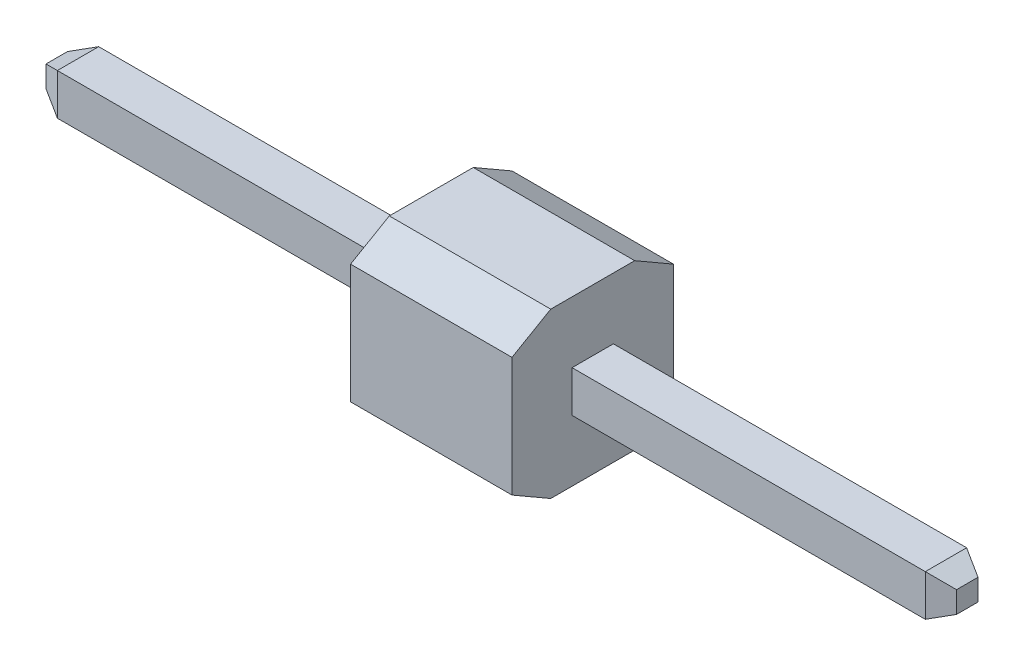
ISO-10303-21;
HEADER;
FILE_DESCRIPTION(('STEP AP214'),'2;1');
FILE_NAME('part.step','',(''),(''),'','','');
FILE_SCHEMA(('AUTOMOTIVE_DESIGN { 1 0 10303 214 1 1 1 1 }'));
ENDSEC;
DATA;
#1=APPLICATION_CONTEXT('core data for automotive mechanical design processes');
#2=APPLICATION_PROTOCOL_DEFINITION('international standard','automotive_design',2000,#1);
#3=PRODUCT_CONTEXT('',#1,'mechanical');
#4=PRODUCT('Part','Part','',(#3));
#5=PRODUCT_RELATED_PRODUCT_CATEGORY('part','',(#4));
#6=PRODUCT_DEFINITION_FORMATION('','',#4);
#7=PRODUCT_DEFINITION_CONTEXT('part definition',#1,'design');
#8=PRODUCT_DEFINITION('design','',#6,#7);
#9=PRODUCT_DEFINITION_SHAPE('','',#8);
#10=(LENGTH_UNIT() NAMED_UNIT(*) SI_UNIT(.MILLI.,.METRE.));
#11=(NAMED_UNIT(*) PLANE_ANGLE_UNIT() SI_UNIT($,.RADIAN.));
#12=(NAMED_UNIT(*) SI_UNIT($,.STERADIAN.) SOLID_ANGLE_UNIT());
#13=UNCERTAINTY_MEASURE_WITH_UNIT(LENGTH_MEASURE(1.E-05),#10,'distance_accuracy_value','');
#14=(GEOMETRIC_REPRESENTATION_CONTEXT(3) GLOBAL_UNCERTAINTY_ASSIGNED_CONTEXT((#13)) GLOBAL_UNIT_ASSIGNED_CONTEXT((#10,
#11,#12)) REPRESENTATION_CONTEXT('',''));
#15=CARTESIAN_POINT('',(0.,0.,0.));
#16=DIRECTION('',(0.,0.,1.));
#17=DIRECTION('',(1.,0.,0.));
#18=AXIS2_PLACEMENT_3D('',#15,#16,#17);
#19=CARTESIAN_POINT('',(5.42107464275443,-9.84288427394286,-2.77111970734936));
#20=DIRECTION('',(1.,-9.93476518829084E-08,4.37113882867379E-08));
#21=DIRECTION('',(-9.93476589883358E-08,-1.,8.74227765734759E-08));
#22=AXIS2_PLACEMENT_3D('',#19,#20,#21);
#23=PLANE('',#22);
#24=DIRECTION('',(-1.18186632778994E-08,-0.500000075710538,-0.866025360072935));
#25=VECTOR('',#24,1.);
#26=CARTESIAN_POINT('',(5.42107445057982,-11.0864739751751,-1.20111959863128));
#27=LINE('',#26,#25);
#28=CARTESIAN_POINT('',(5.42107445057982,-11.0864739751751,-1.20111959863128));
#29=VERTEX_POINT('',#28);
#30=CARTESIAN_POINT('',(5.42107444239161,-11.4328841891428,-1.80111956834714));
#31=VERTEX_POINT('',#30);
#32=EDGE_CURVE('E11',#29,#31,#27,.T.);
#33=ORIENTED_EDGE('',*,*,#32,.T.);
#34=DIRECTION('',(4.37113811813104E-08,-8.74227842254741E-08,-0.999999999999995));
#35=VECTOR('',#34,1.);
#36=CARTESIAN_POINT('',(5.42107444239161,-11.4328841891428,-1.80111956834714));
#37=LINE('',#36,#35);
#38=CARTESIAN_POINT('',(5.42107449921641,-11.4328843027924,-3.10111956834714));
#39=VERTEX_POINT('',#38);
#40=EDGE_CURVE('E304',#31,#39,#37,.T.);
#41=ORIENTED_EDGE('',*,*,#40,.T.);
#42=DIRECTION('',(8.75289963529268E-08,0.499999924289837,-0.866025447495713));
#43=VECTOR('',#42,1.);
#44=CARTESIAN_POINT('',(5.42107449921641,-11.4328843027924,-3.10111956834714));
#45=LINE('',#44,#43);
#46=CARTESIAN_POINT('',(5.42107455985828,-11.086474193732,-3.70111959863128));
#47=VERTEX_POINT('',#46);
#48=EDGE_CURVE('E296',#39,#47,#45,.T.);
#49=ORIENTED_EDGE('',*,*,#48,.T.);
#50=DIRECTION('',(9.93476593243698E-08,0.999999999999991,-8.74227764821842E-08));
#51=VECTOR('',#50,1.);
#52=CARTESIAN_POINT('',(5.42107455985828,-11.086474193732,-3.70111959863128));
#53=LINE('',#52,#51);
#54=CARTESIAN_POINT('',(5.42107474337125,-9.23929451676005,-3.70111976011686));
#55=VERTEX_POINT('',#54);
#56=EDGE_CURVE('E281',#47,#55,#53,.T.);
#57=ORIENTED_EDGE('',*,*,#56,.T.);
#58=DIRECTION('',(-1.18186619959243E-08,-0.500000075710538,-0.866025360072935));
#59=VECTOR('',#58,1.);
#60=CARTESIAN_POINT('',(5.42107475155946,-8.89288430279238,-3.10111979040099));
#61=LINE('',#60,#59);
#62=CARTESIAN_POINT('',(5.42107475155946,-8.89288430279238,-3.10111979040099));
#63=VERTEX_POINT('',#62);
#64=EDGE_CURVE('E265',#63,#55,#61,.T.);
#65=ORIENTED_EDGE('',*,*,#64,.F.);
#66=DIRECTION('',(4.37113811813104E-08,-8.74227842254741E-08,-0.999999999999995));
#67=VECTOR('',#66,1.);
#68=CARTESIAN_POINT('',(5.42107469473467,-8.89288418914276,-1.80111979040099));
#69=LINE('',#68,#67);
#70=CARTESIAN_POINT('',(5.42107469473467,-8.89288418914276,-1.80111979040099));
#71=VERTEX_POINT('',#70);
#72=EDGE_CURVE('E248',#71,#63,#69,.T.);
#73=ORIENTED_EDGE('',*,*,#72,.F.);
#74=DIRECTION('',(8.75289950709517E-08,0.499999924289837,-0.866025447495713));
#75=VECTOR('',#74,1.);
#76=CARTESIAN_POINT('',(5.4210746340928,-9.23929429820309,-1.20111976011686));
#77=LINE('',#76,#75);
#78=CARTESIAN_POINT('',(5.4210746340928,-9.23929429820309,-1.20111976011686));
#79=VERTEX_POINT('',#78);
#80=EDGE_CURVE('E242',#79,#71,#77,.T.);
#81=ORIENTED_EDGE('',*,*,#80,.F.);
#82=DIRECTION('',(9.93476593243698E-08,0.999999999999991,-8.74227764821842E-08));
#83=VECTOR('',#82,1.);
#84=CARTESIAN_POINT('',(5.42107445057982,-11.0864739751751,-1.20111959863128));
#85=LINE('',#84,#83);
#86=EDGE_CURVE('E236',#29,#79,#85,.T.);
#87=ORIENTED_EDGE('',*,*,#86,.F.);
#88=EDGE_LOOP('',(#33,#41,#49,#57,#65,#73,#81,#87));
#89=FACE_BOUND('',#88,.T.);
#90=DIRECTION('',(-4.37113817364219E-08,8.74227829017466E-08,0.999999999999995));
#91=VECTOR('',#90,1.);
#92=CARTESIAN_POINT('',(5.42107457917193,-10.4828842739429,-2.77111965139878));
#93=LINE('',#92,#91);
#94=CARTESIAN_POINT('',(5.42107457917193,-10.4828842739429,-2.77111965139878));
#95=VERTEX_POINT('',#94);
#96=CARTESIAN_POINT('',(5.42107455119664,-10.4828842179923,-2.13111965139878));
#97=VERTEX_POINT('',#96);
#98=EDGE_CURVE('E302',#95,#97,#93,.T.);
#99=ORIENTED_EDGE('',*,*,#98,.T.);
#100=DIRECTION('',(-9.93476592658906E-08,-0.999999999999991,8.74227766567418E-08));
#101=VECTOR('',#100,1.);
#102=CARTESIAN_POINT('',(5.42107461477915,-9.84288421799228,-2.13111970734936));
#103=LINE('',#102,#101);
#104=CARTESIAN_POINT('',(5.42107461477915,-9.84288421799228,-2.13111970734936));
#105=VERTEX_POINT('',#104);
#106=EDGE_CURVE('E293',#105,#97,#103,.T.);
#107=ORIENTED_EDGE('',*,*,#106,.F.);
#108=DIRECTION('',(-4.37113817364219E-08,8.74227856773042E-08,0.999999999999995));
#109=VECTOR('',#108,1.);
#110=CARTESIAN_POINT('',(5.42107464275443,-9.84288427394286,-2.77111970734936));
#111=LINE('',#110,#109);
#112=CARTESIAN_POINT('',(5.42107464275443,-9.84288427394286,-2.77111970734936));
#113=VERTEX_POINT('',#112);
#114=EDGE_CURVE('E278',#113,#105,#111,.T.);
#115=ORIENTED_EDGE('',*,*,#114,.F.);
#116=DIRECTION('',(-9.93476592658908E-08,-0.999999999999991,8.7422776656742E-08));
#117=VECTOR('',#116,1.);
#118=CARTESIAN_POINT('',(5.42107464275443,-9.84288427394286,-2.77111970734936));
#119=LINE('',#118,#117);
#120=EDGE_CURVE('E263',#113,#95,#119,.T.);
#121=ORIENTED_EDGE('',*,*,#120,.T.);
#122=EDGE_LOOP('',(#99,#107,#115,#121));
#123=FACE_BOUND('',#122,.T.);
#124=ADVANCED_FACE('F17',(#89,#123),#23,.T.);
#125=CARTESIAN_POINT('',(2.92107464275443,-9.84288402557373,-2.77111981662783));
#126=DIRECTION('',(1.,-9.93476518829084E-08,4.37113882867379E-08));
#127=DIRECTION('',(-9.93476589883358E-08,-1.,8.74227765734759E-08));
#128=AXIS2_PLACEMENT_3D('',#125,#126,#127);
#129=PLANE('',#128);
#130=DIRECTION('',(-1.18186632778994E-08,-0.500000075710538,-0.866025360072935));
#131=VECTOR('',#130,1.);
#132=CARTESIAN_POINT('',(2.92107445057982,-11.086473726806,-1.20111970790975));
#133=LINE('',#132,#131);
#134=CARTESIAN_POINT('',(2.92107445057982,-11.086473726806,-1.20111970790975));
#135=VERTEX_POINT('',#134);
#136=CARTESIAN_POINT('',(2.92107444239161,-11.4328839407736,-1.80111967762561));
#137=VERTEX_POINT('',#136);
#138=EDGE_CURVE('E24',#135,#137,#133,.T.);
#139=ORIENTED_EDGE('',*,*,#138,.F.);
#140=DIRECTION('',(9.9347659083955E-08,0.999999999999991,-8.74227764821842E-08));
#141=VECTOR('',#140,1.);
#142=CARTESIAN_POINT('',(2.92107445057982,-11.086473726806,-1.20111970790975));
#143=LINE('',#142,#141);
#144=CARTESIAN_POINT('',(2.9210746340928,-9.23929404983396,-1.20111986939533));
#145=VERTEX_POINT('',#144);
#146=EDGE_CURVE('E300',#135,#145,#143,.T.);
#147=ORIENTED_EDGE('',*,*,#146,.T.);
#148=DIRECTION('',(8.75289957119392E-08,0.499999924289837,-0.866025447495713));
#149=VECTOR('',#148,1.);
#150=CARTESIAN_POINT('',(2.9210746340928,-9.23929404983396,-1.20111986939533));
#151=LINE('',#150,#149);
#152=CARTESIAN_POINT('',(2.92107469473467,-8.89288394077363,-1.80111989967946));
#153=VERTEX_POINT('',#152);
#154=EDGE_CURVE('E286',#145,#153,#151,.T.);
#155=ORIENTED_EDGE('',*,*,#154,.T.);
#156=DIRECTION('',(4.37113811813104E-08,-8.74227842254741E-08,-0.999999999999995));
#157=VECTOR('',#156,1.);
#158=CARTESIAN_POINT('',(2.92107469473467,-8.89288394077363,-1.80111989967946));
#159=LINE('',#158,#157);
#160=CARTESIAN_POINT('',(2.92107475155946,-8.89288405442325,-3.10111989967946));
#161=VERTEX_POINT('',#160);
#162=EDGE_CURVE('E271',#153,#161,#159,.T.);
#163=ORIENTED_EDGE('',*,*,#162,.T.);
#164=DIRECTION('',(-1.18186626369119E-08,-0.500000075710538,-0.866025360072935));
#165=VECTOR('',#164,1.);
#166=CARTESIAN_POINT('',(2.92107475155946,-8.89288405442325,-3.10111989967946));
#167=LINE('',#166,#165);
#168=CARTESIAN_POINT('',(2.92107474337125,-9.23929426839092,-3.70111986939533));
#169=VERTEX_POINT('',#168);
#170=EDGE_CURVE('E253',#161,#169,#167,.T.);
#171=ORIENTED_EDGE('',*,*,#170,.T.);
#172=DIRECTION('',(9.9347659083955E-08,0.999999999999991,-8.74227764821842E-08));
#173=VECTOR('',#172,1.);
#174=CARTESIAN_POINT('',(2.92107455985828,-11.0864739453629,-3.70111970790975));
#175=LINE('',#174,#173);
#176=CARTESIAN_POINT('',(2.92107455985828,-11.0864739453629,-3.70111970790975));
#177=VERTEX_POINT('',#176);
#178=EDGE_CURVE('E261',#177,#169,#175,.T.);
#179=ORIENTED_EDGE('',*,*,#178,.F.);
#180=DIRECTION('',(8.75289963529268E-08,0.499999924289837,-0.866025447495713));
#181=VECTOR('',#180,1.);
#182=CARTESIAN_POINT('',(2.92107449921641,-11.4328840544232,-3.10111967762561));
#183=LINE('',#182,#181);
#184=CARTESIAN_POINT('',(2.92107449921641,-11.4328840544232,-3.10111967762561));
#185=VERTEX_POINT('',#184);
#186=EDGE_CURVE('E276',#185,#177,#183,.T.);
#187=ORIENTED_EDGE('',*,*,#186,.F.);
#188=DIRECTION('',(4.37113811813104E-08,-8.74227842254741E-08,-0.999999999999995));
#189=VECTOR('',#188,1.);
#190=CARTESIAN_POINT('',(2.92107444239161,-11.4328839407736,-1.80111967762561));
#191=LINE('',#190,#189);
#192=EDGE_CURVE('E291',#137,#185,#191,.T.);
#193=ORIENTED_EDGE('',*,*,#192,.F.);
#194=EDGE_LOOP('',(#139,#147,#155,#163,#171,#179,#187,#193));
#195=FACE_BOUND('',#194,.T.);
#196=DIRECTION('',(-9.93476585720012E-08,-0.999999999999991,8.74227766567418E-08));
#197=VECTOR('',#196,1.);
#198=CARTESIAN_POINT('',(2.92107461477915,-9.84288396962315,-2.13111981662783));
#199=LINE('',#198,#197);
#200=CARTESIAN_POINT('',(2.92107461477915,-9.84288396962315,-2.13111981662783));
#201=VERTEX_POINT('',#200);
#202=CARTESIAN_POINT('',(2.92107455119665,-10.4828839696231,-2.13111976067725));
#203=VERTEX_POINT('',#202);
#204=EDGE_CURVE('E298',#201,#203,#199,.T.);
#205=ORIENTED_EDGE('',*,*,#204,.T.);
#206=DIRECTION('',(-4.37113810425325E-08,8.74227829017466E-08,0.999999999999995));
#207=VECTOR('',#206,1.);
#208=CARTESIAN_POINT('',(2.92107457917193,-10.4828840255737,-2.77111976067725));
#209=LINE('',#208,#207);
#210=CARTESIAN_POINT('',(2.92107457917193,-10.4828840255737,-2.77111976067725));
#211=VERTEX_POINT('',#210);
#212=EDGE_CURVE('E283',#211,#203,#209,.T.);
#213=ORIENTED_EDGE('',*,*,#212,.F.);
#214=DIRECTION('',(-9.93476592658908E-08,-0.999999999999991,8.7422776656742E-08));
#215=VECTOR('',#214,1.);
#216=CARTESIAN_POINT('',(2.92107464275443,-9.84288402557373,-2.77111981662783));
#217=LINE('',#216,#215);
#218=CARTESIAN_POINT('',(2.92107464275443,-9.84288402557373,-2.77111981662783));
#219=VERTEX_POINT('',#218);
#220=EDGE_CURVE('E268',#219,#211,#217,.T.);
#221=ORIENTED_EDGE('',*,*,#220,.F.);
#222=DIRECTION('',(-4.37113817364219E-08,8.74227856773042E-08,0.999999999999995));
#223=VECTOR('',#222,1.);
#224=CARTESIAN_POINT('',(2.92107464275443,-9.84288402557373,-2.77111981662783));
#225=LINE('',#224,#223);
#226=EDGE_CURVE('E251',#219,#201,#225,.T.);
#227=ORIENTED_EDGE('',*,*,#226,.T.);
#228=EDGE_LOOP('',(#205,#213,#221,#227));
#229=FACE_BOUND('',#228,.T.);
#230=ADVANCED_FACE('F314',(#195,#229),#129,.F.);
#231=CARTESIAN_POINT('',(5.42107445057982,-11.0864739751751,-1.20111959863128));
#232=DIRECTION('',(1.07893287081065E-07,0.866025360072937,-0.500000075710535));
#233=DIRECTION('',(1.18186629566715E-08,0.500000075710542,0.866025360072941));
#234=AXIS2_PLACEMENT_3D('',#231,#232,#233);
#235=PLANE('',#234);
#236=ORIENTED_EDGE('',*,*,#138,.T.);
#237=DIRECTION('',(-0.999999999999994,9.93476518829078E-08,-4.37113883755555E-08));
#238=VECTOR('',#237,1.);
#239=CARTESIAN_POINT('',(5.42107444239161,-11.4328841891428,-1.80111956834714));
#240=LINE('',#239,#238);
#241=EDGE_CURVE('E288',#31,#137,#240,.T.);
#242=ORIENTED_EDGE('',*,*,#241,.F.);
#243=ORIENTED_EDGE('',*,*,#32,.F.);
#244=DIRECTION('',(-0.999999999999994,9.93476518829078E-08,-4.3711388109102E-08));
#245=VECTOR('',#244,1.);
#246=CARTESIAN_POINT('',(5.42107445057982,-11.0864739751751,-1.20111959863128));
#247=LINE('',#246,#245);
#248=EDGE_CURVE('E256',#29,#135,#247,.T.);
#249=ORIENTED_EDGE('',*,*,#248,.T.);
#250=EDGE_LOOP('',(#236,#242,#243,#249));
#251=FACE_BOUND('',#250,.T.);
#252=ADVANCED_FACE('F306',(#251),#235,.F.);
#253=CARTESIAN_POINT('',(5.42107444239161,-11.4328841891428,-1.80111956834714));
#254=DIRECTION('',(9.93476589883358E-08,1.,-8.74227765734759E-08));
#255=DIRECTION('',(1.,-9.93476518829084E-08,4.37113882867379E-08));
#256=AXIS2_PLACEMENT_3D('',#253,#254,#255);
#257=PLANE('',#256);
#258=ORIENTED_EDGE('',*,*,#192,.T.);
#259=DIRECTION('',(-0.999999999999994,9.93476518829078E-08,-4.37113882867377E-08));
#260=VECTOR('',#259,1.);
#261=CARTESIAN_POINT('',(5.42107449921641,-11.4328843027924,-3.10111956834714));
#262=LINE('',#261,#260);
#263=EDGE_CURVE('E273',#39,#185,#262,.T.);
#264=ORIENTED_EDGE('',*,*,#263,.F.);
#265=ORIENTED_EDGE('',*,*,#40,.F.);
#266=ORIENTED_EDGE('',*,*,#241,.T.);
#267=EDGE_LOOP('',(#258,#264,#265,#266));
#268=FACE_BOUND('',#267,.T.);
#269=ADVANCED_FACE('F311',(#268),#257,.F.);
#270=CARTESIAN_POINT('',(5.42107449921641,-11.4328843027924,-3.10111956834714));
#271=DIRECTION('',(6.41819058997377E-08,0.866025447495721,0.499999924289845));
#272=DIRECTION('',(-8.7528996031702E-08,-0.499999924289838,0.866025447495717));
#273=AXIS2_PLACEMENT_3D('',#270,#271,#272);
#274=PLANE('',#273);
#275=ORIENTED_EDGE('',*,*,#186,.T.);
#276=DIRECTION('',(-0.999999999999994,9.93476518829078E-08,-4.37113882867377E-08));
#277=VECTOR('',#276,1.);
#278=CARTESIAN_POINT('',(5.42107455985828,-11.086474193732,-3.70111959863128));
#279=LINE('',#278,#277);
#280=EDGE_CURVE('E258',#47,#177,#279,.T.);
#281=ORIENTED_EDGE('',*,*,#280,.F.);
#282=ORIENTED_EDGE('',*,*,#48,.F.);
#283=ORIENTED_EDGE('',*,*,#263,.T.);
#284=EDGE_LOOP('',(#275,#281,#282,#283));
#285=FACE_BOUND('',#284,.T.);
#286=ADVANCED_FACE('F319',(#285),#274,.F.);
#287=CARTESIAN_POINT('',(5.42107455985828,-11.086474193732,-3.70111959863128));
#288=DIRECTION('',(-4.37113811813106E-08,8.74227836789032E-08,1.));
#289=DIRECTION('',(-1.,9.93476518829084E-08,-4.37113882867379E-08));
#290=AXIS2_PLACEMENT_3D('',#287,#288,#289);
#291=PLANE('',#290);
#292=ORIENTED_EDGE('',*,*,#178,.T.);
#293=DIRECTION('',(-0.999999999999994,9.93476525934505E-08,-4.37113882867377E-08));
#294=VECTOR('',#293,1.);
#295=CARTESIAN_POINT('',(5.42107474337125,-9.23929451676005,-3.70111976011686));
#296=LINE('',#295,#294);
#297=EDGE_CURVE('E245',#55,#169,#296,.T.);
#298=ORIENTED_EDGE('',*,*,#297,.F.);
#299=ORIENTED_EDGE('',*,*,#56,.F.);
#300=ORIENTED_EDGE('',*,*,#280,.T.);
#301=EDGE_LOOP('',(#292,#298,#299,#300));
#302=FACE_BOUND('',#301,.T.);
#303=ADVANCED_FACE('F326',(#302),#291,.F.);
#304=CARTESIAN_POINT('',(5.42107475155946,-8.89288430279238,-3.10111979040099));
#305=DIRECTION('',(1.07893287081065E-07,0.866025360072937,-0.500000075710535));
#306=DIRECTION('',(1.18186629566715E-08,0.500000075710542,0.866025360072941));
#307=AXIS2_PLACEMENT_3D('',#304,#305,#306);
#308=PLANE('',#307);
#309=ORIENTED_EDGE('',*,*,#170,.F.);
#310=DIRECTION('',(-0.999999999999994,9.93476518829078E-08,-4.37113882867377E-08));
#311=VECTOR('',#310,1.);
#312=CARTESIAN_POINT('',(5.42107475155946,-8.89288430279238,-3.10111979040099));
#313=LINE('',#312,#311);
#314=EDGE_CURVE('E239',#63,#161,#313,.T.);
#315=ORIENTED_EDGE('',*,*,#314,.F.);
#316=ORIENTED_EDGE('',*,*,#64,.T.);
#317=ORIENTED_EDGE('',*,*,#297,.T.);
#318=EDGE_LOOP('',(#309,#315,#316,#317));
#319=FACE_BOUND('',#318,.T.);
#320=ADVANCED_FACE('F329',(#319),#308,.T.);
#321=CARTESIAN_POINT('',(5.42107469473467,-8.89288418914276,-1.80111979040099));
#322=DIRECTION('',(9.93476589883358E-08,1.,-8.74227765734759E-08));
#323=DIRECTION('',(1.,-9.93476518829084E-08,4.37113882867379E-08));
#324=AXIS2_PLACEMENT_3D('',#321,#322,#323);
#325=PLANE('',#324);
#326=ORIENTED_EDGE('',*,*,#162,.F.);
#327=DIRECTION('',(-0.999999999999994,9.93476518829078E-08,-4.37113883755555E-08));
#328=VECTOR('',#327,1.);
#329=CARTESIAN_POINT('',(5.42107469473467,-8.89288418914276,-1.80111979040099));
#330=LINE('',#329,#328);
#331=EDGE_CURVE('E233',#71,#153,#330,.T.);
#332=ORIENTED_EDGE('',*,*,#331,.F.);
#333=ORIENTED_EDGE('',*,*,#72,.T.);
#334=ORIENTED_EDGE('',*,*,#314,.T.);
#335=EDGE_LOOP('',(#326,#332,#333,#334));
#336=FACE_BOUND('',#335,.T.);
#337=ADVANCED_FACE('F333',(#336),#325,.T.);
#338=CARTESIAN_POINT('',(5.4210746340928,-9.23929429820309,-1.20111976011686));
#339=DIRECTION('',(6.41819058997377E-08,0.866025447495721,0.499999924289845));
#340=DIRECTION('',(-8.7528996031702E-08,-0.499999924289838,0.866025447495717));
#341=AXIS2_PLACEMENT_3D('',#338,#339,#340);
#342=PLANE('',#341);
#343=ORIENTED_EDGE('',*,*,#154,.F.);
#344=DIRECTION('',(-0.999999999999994,9.93476525934505E-08,-4.3711388109102E-08));
#345=VECTOR('',#344,1.);
#346=CARTESIAN_POINT('',(5.4210746340928,-9.23929429820309,-1.20111976011686));
#347=LINE('',#346,#345);
#348=EDGE_CURVE('E230',#79,#145,#347,.T.);
#349=ORIENTED_EDGE('',*,*,#348,.F.);
#350=ORIENTED_EDGE('',*,*,#80,.T.);
#351=ORIENTED_EDGE('',*,*,#331,.T.);
#352=EDGE_LOOP('',(#343,#349,#350,#351));
#353=FACE_BOUND('',#352,.T.);
#354=ADVANCED_FACE('F337',(#353),#342,.T.);
#355=CARTESIAN_POINT('',(5.42107445057982,-11.0864739751751,-1.20111959863128));
#356=DIRECTION('',(-4.37113811813106E-08,8.74227835615132E-08,1.));
#357=DIRECTION('',(-9.93476589883358E-08,-1.,8.74227764560859E-08));
#358=AXIS2_PLACEMENT_3D('',#355,#356,#357);
#359=PLANE('',#358);
#360=ORIENTED_EDGE('',*,*,#146,.F.);
#361=ORIENTED_EDGE('',*,*,#248,.F.);
#362=ORIENTED_EDGE('',*,*,#86,.T.);
#363=ORIENTED_EDGE('',*,*,#348,.T.);
#364=EDGE_LOOP('',(#360,#361,#362,#363));
#365=FACE_BOUND('',#364,.T.);
#366=ADVANCED_FACE('F339',(#365),#359,.T.);
#367=CARTESIAN_POINT('',(-2.87892535724557,-9.84288344935735,-2.77112007015388));
#368=DIRECTION('',(-1.,9.93476518829084E-08,-4.37113882867379E-08));
#369=DIRECTION('',(9.93476589883358E-08,1.,-8.74227765734759E-08));
#370=AXIS2_PLACEMENT_3D('',#367,#368,#369);
#371=PLANE('',#370);
#372=DIRECTION('',(9.93476581453995E-08,0.999999999999991,-8.74227761394067E-08));
#373=VECTOR('',#372,1.);
#374=CARTESIAN_POINT('',(-2.87892542678921,-10.3290018796685,-2.28500155484705));
#375=LINE('',#374,#373);
#376=CARTESIAN_POINT('',(-2.87892542678921,-10.3290018796685,-2.28500155484705));
#377=VERTEX_POINT('',#376);
#378=CARTESIAN_POINT('',(-2.87892539378225,-9.99676493405052,-2.28500158389213));
#379=VERTEX_POINT('',#378);
#380=EDGE_CURVE('E228',#377,#379,#375,.T.);
#381=ORIENTED_EDGE('',*,*,#380,.T.);
#382=DIRECTION('',(4.37113820547149E-08,-8.74227801493995E-08,-0.999999999999995));
#383=VECTOR('',#382,1.);
#384=CARTESIAN_POINT('',(-2.87892539378225,-9.99676493405052,-2.28500158389213));
#385=LINE('',#384,#383);
#386=CARTESIAN_POINT('',(-2.87892537925971,-9.9967649630956,-2.61723852951013));
#387=VERTEX_POINT('',#386);
#388=EDGE_CURVE('E223',#379,#387,#385,.T.);
#389=ORIENTED_EDGE('',*,*,#388,.T.);
#390=DIRECTION('',(-9.93476608187272E-08,-0.999999999999991,8.74227761394063E-08));
#391=VECTOR('',#390,1.);
#392=CARTESIAN_POINT('',(-2.87892537925971,-9.9967649630956,-2.61723852951013));
#393=LINE('',#392,#391);
#394=CARTESIAN_POINT('',(-2.87892541226668,-10.3290019087136,-2.61723850046505));
#395=VERTEX_POINT('',#394);
#396=EDGE_CURVE('E215',#387,#395,#393,.T.);
#397=ORIENTED_EDGE('',*,*,#396,.T.);
#398=DIRECTION('',(-4.37113740347301E-08,8.74227801493995E-08,0.999999999999995));
#399=VECTOR('',#398,1.);
#400=CARTESIAN_POINT('',(-2.87892541226668,-10.3290019087136,-2.61723850046505));
#401=LINE('',#400,#399);
#402=EDGE_CURVE('E207',#395,#377,#401,.T.);
#403=ORIENTED_EDGE('',*,*,#402,.T.);
#404=EDGE_LOOP('',(#381,#389,#397,#403));
#405=FACE_BOUND('',#404,.T.);
#406=ADVANCED_FACE('F341',(#405),#371,.T.);
#407=CARTESIAN_POINT('',(-2.87892535724557,-9.84288344935735,-2.77112007015388));
#408=DIRECTION('',(9.93476589883358E-08,1.,-8.74227764510112E-08));
#409=DIRECTION('',(-4.37113811813106E-08,8.74227835564385E-08,1.));
#410=AXIS2_PLACEMENT_3D('',#407,#408,#409);
#411=PLANE('',#410);
#412=DIRECTION('',(0.999999999999994,-9.93476521037346E-08,4.37113882769953E-08));
#413=VECTOR('',#412,1.);
#414=CARTESIAN_POINT('',(-2.54892535724557,-9.84288348214207,-2.77112005572912));
#415=LINE('',#414,#413);
#416=CARTESIAN_POINT('',(-2.54892535724557,-9.84288348214207,-2.77112005572912));
#417=VERTEX_POINT('',#416);
#418=EDGE_CURVE('E225',#417,#219,#415,.T.);
#419=ORIENTED_EDGE('',*,*,#418,.F.);
#420=DIRECTION('',(-4.37113817364219E-08,8.74227829017466E-08,0.999999999999995));
#421=VECTOR('',#420,1.);
#422=CARTESIAN_POINT('',(-2.54892535724557,-9.84288348214207,-2.77112005572912));
#423=LINE('',#422,#421);
#424=CARTESIAN_POINT('',(-2.54892538522085,-9.84288342619149,-2.13112005572912));
#425=VERTEX_POINT('',#424);
#426=EDGE_CURVE('E217',#417,#425,#423,.T.);
#427=ORIENTED_EDGE('',*,*,#426,.T.);
#428=DIRECTION('',(0.999999999999994,-9.93476521037346E-08,4.3711388195809E-08));
#429=VECTOR('',#428,1.);
#430=CARTESIAN_POINT('',(-2.54892538522085,-9.84288342619149,-2.13112005572912));
#431=LINE('',#430,#429);
#432=EDGE_CURVE('E220',#425,#201,#431,.T.);
#433=ORIENTED_EDGE('',*,*,#432,.T.);
#434=ORIENTED_EDGE('',*,*,#226,.F.);
#435=EDGE_LOOP('',(#419,#427,#433,#434));
#436=FACE_BOUND('',#435,.T.);
#437=ADVANCED_FACE('F348',(#436),#411,.T.);
#438=CARTESIAN_POINT('',(-2.87892538522085,-9.84288339340677,-2.13112007015388));
#439=DIRECTION('',(-4.37113811813106E-08,8.74227836789032E-08,1.));
#440=DIRECTION('',(-1.,9.93476518829084E-08,-4.37113882867379E-08));
#441=AXIS2_PLACEMENT_3D('',#438,#439,#440);
#442=PLANE('',#441);
#443=ORIENTED_EDGE('',*,*,#432,.F.);
#444=DIRECTION('',(-9.93476592658906E-08,-0.999999999999991,8.74227766567418E-08));
#445=VECTOR('',#444,1.);
#446=CARTESIAN_POINT('',(-2.54892538522085,-9.84288342619149,-2.13112005572912));
#447=LINE('',#446,#445);
#448=CARTESIAN_POINT('',(-2.54892544880336,-10.4828834261915,-2.13111999977854));
#449=VERTEX_POINT('',#448);
#450=EDGE_CURVE('E209',#425,#449,#447,.T.);
#451=ORIENTED_EDGE('',*,*,#450,.T.);
#452=DIRECTION('',(0.999999999999994,-9.93476517789893E-08,4.3711388195809E-08));
#453=VECTOR('',#452,1.);
#454=CARTESIAN_POINT('',(-2.54892544880336,-10.4828834261915,-2.13111999977854));
#455=LINE('',#454,#453);
#456=EDGE_CURVE('E212',#449,#203,#455,.T.);
#457=ORIENTED_EDGE('',*,*,#456,.T.);
#458=ORIENTED_EDGE('',*,*,#204,.F.);
#459=EDGE_LOOP('',(#443,#451,#457,#458));
#460=FACE_BOUND('',#459,.T.);
#461=ADVANCED_FACE('F424',(#460),#442,.T.);
#462=CARTESIAN_POINT('',(-2.87892542082807,-10.4828834493573,-2.7711200142033));
#463=DIRECTION('',(9.93476589883357E-08,1.,-8.74227764040693E-08));
#464=DIRECTION('',(-4.37113811813106E-08,8.74227835094966E-08,1.));
#465=AXIS2_PLACEMENT_3D('',#462,#463,#464);
#466=PLANE('',#465);
#467=ORIENTED_EDGE('',*,*,#456,.F.);
#468=DIRECTION('',(4.37113831242006E-08,-8.74227829017466E-08,-0.999999999999995));
#469=VECTOR('',#468,1.);
#470=CARTESIAN_POINT('',(-2.54892544880336,-10.4828834261915,-2.13111999977854));
#471=LINE('',#470,#469);
#472=CARTESIAN_POINT('',(-2.54892542082807,-10.4828834821421,-2.77111999977854));
#473=VERTEX_POINT('',#472);
#474=EDGE_CURVE('E201',#449,#473,#471,.T.);
#475=ORIENTED_EDGE('',*,*,#474,.T.);
#476=DIRECTION('',(0.999999999999994,-9.93476517789893E-08,4.37113882769953E-08));
#477=VECTOR('',#476,1.);
#478=CARTESIAN_POINT('',(-2.54892542082807,-10.4828834821421,-2.77111999977854));
#479=LINE('',#478,#477);
#480=EDGE_CURVE('E204',#473,#211,#479,.T.);
#481=ORIENTED_EDGE('',*,*,#480,.T.);
#482=ORIENTED_EDGE('',*,*,#212,.T.);
#483=EDGE_LOOP('',(#467,#475,#481,#482));
#484=FACE_BOUND('',#483,.T.);
#485=ADVANCED_FACE('F421',(#484),#466,.F.);
#486=CARTESIAN_POINT('',(-2.87892535724557,-9.84288344935735,-2.77112007015388));
#487=DIRECTION('',(-4.37113811813106E-08,8.74227836789032E-08,1.));
#488=DIRECTION('',(-1.,9.93476518829084E-08,-4.37113882867379E-08));
#489=AXIS2_PLACEMENT_3D('',#486,#487,#488);
#490=PLANE('',#489);
#491=ORIENTED_EDGE('',*,*,#480,.F.);
#492=DIRECTION('',(9.93476606536693E-08,0.999999999999991,-8.74227766567418E-08));
#493=VECTOR('',#492,1.);
#494=CARTESIAN_POINT('',(-2.54892542082807,-10.4828834821421,-2.77111999977854));
#495=LINE('',#494,#493);
#496=EDGE_CURVE('E196',#473,#417,#495,.T.);
#497=ORIENTED_EDGE('',*,*,#496,.T.);
#498=ORIENTED_EDGE('',*,*,#418,.T.);
#499=ORIENTED_EDGE('',*,*,#220,.T.);
#500=EDGE_LOOP('',(#491,#497,#498,#499));
#501=FACE_BOUND('',#500,.T.);
#502=ADVANCED_FACE('F376',(#501),#490,.F.);
#503=CARTESIAN_POINT('',(-2.87892535724557,-9.84288344935735,-2.77112007015388));
#504=DIRECTION('',(-4.37113811813106E-08,8.74227836789032E-08,1.));
#505=DIRECTION('',(-1.,9.93476518829084E-08,-4.37113882867379E-08));
#506=AXIS2_PLACEMENT_3D('',#503,#504,#505);
#507=PLANE('',#506);
#508=DIRECTION('',(0.999999999999994,-9.93476517789893E-08,4.37113882769953E-08));
#509=VECTOR('',#508,1.);
#510=CARTESIAN_POINT('',(5.42107464275443,-9.84288427394286,-2.77111970734936));
#511=LINE('',#510,#509);
#512=CARTESIAN_POINT('',(10.8910746427544,-9.84288481737452,-2.77111946824806));
#513=VERTEX_POINT('',#512);
#514=EDGE_CURVE('E199',#113,#513,#511,.T.);
#515=ORIENTED_EDGE('',*,*,#514,.T.);
#516=DIRECTION('',(-9.93476606536693E-08,-0.999999999999991,8.74227766567418E-08));
#517=VECTOR('',#516,1.);
#518=CARTESIAN_POINT('',(10.8910746427544,-9.84288481737452,-2.77111946824806));
#519=LINE('',#518,#517);
#520=CARTESIAN_POINT('',(10.8910745791719,-10.4828848173745,-2.77111941229749));
#521=VERTEX_POINT('',#520);
#522=EDGE_CURVE('E191',#513,#521,#519,.T.);
#523=ORIENTED_EDGE('',*,*,#522,.T.);
#524=DIRECTION('',(0.999999999999994,-9.93476521037346E-08,4.37113882769953E-08));
#525=VECTOR('',#524,1.);
#526=CARTESIAN_POINT('',(5.42107457917193,-10.4828842739429,-2.77111965139878));
#527=LINE('',#526,#525);
#528=EDGE_CURVE('E194',#95,#521,#527,.T.);
#529=ORIENTED_EDGE('',*,*,#528,.F.);
#530=ORIENTED_EDGE('',*,*,#120,.F.);
#531=EDGE_LOOP('',(#515,#523,#529,#530));
#532=FACE_BOUND('',#531,.T.);
#533=ADVANCED_FACE('F367',(#532),#507,.F.);
#534=CARTESIAN_POINT('',(-2.87892542082807,-10.4828834493573,-2.7711200142033));
#535=DIRECTION('',(9.93476589883357E-08,1.,-8.74227764040693E-08));
#536=DIRECTION('',(-4.37113811813106E-08,8.74227835094966E-08,1.));
#537=AXIS2_PLACEMENT_3D('',#534,#535,#536);
#538=PLANE('',#537);
#539=ORIENTED_EDGE('',*,*,#528,.T.);
#540=DIRECTION('',(-4.37113817364219E-08,8.74227829017466E-08,0.999999999999995));
#541=VECTOR('',#540,1.);
#542=CARTESIAN_POINT('',(10.8910745791719,-10.4828848173745,-2.77111941229749));
#543=LINE('',#542,#541);
#544=CARTESIAN_POINT('',(10.8910745511966,-10.4828847614239,-2.13111941229749));
#545=VERTEX_POINT('',#544);
#546=EDGE_CURVE('E186',#521,#545,#543,.T.);
#547=ORIENTED_EDGE('',*,*,#546,.T.);
#548=DIRECTION('',(0.999999999999994,-9.93476521037346E-08,4.37113881146227E-08));
#549=VECTOR('',#548,1.);
#550=CARTESIAN_POINT('',(5.42107455119664,-10.4828842179923,-2.13111965139878));
#551=LINE('',#550,#549);
#552=EDGE_CURVE('E189',#97,#545,#551,.T.);
#553=ORIENTED_EDGE('',*,*,#552,.F.);
#554=ORIENTED_EDGE('',*,*,#98,.F.);
#555=EDGE_LOOP('',(#539,#547,#553,#554));
#556=FACE_BOUND('',#555,.T.);
#557=ADVANCED_FACE('F364',(#556),#538,.F.);
#558=CARTESIAN_POINT('',(-2.87892538522085,-9.84288339340677,-2.13112007015388));
#559=DIRECTION('',(-4.37113811813106E-08,8.74227836789032E-08,1.));
#560=DIRECTION('',(-1.,9.93476518829084E-08,-4.37113882867379E-08));
#561=AXIS2_PLACEMENT_3D('',#558,#559,#560);
#562=PLANE('',#561);
#563=ORIENTED_EDGE('',*,*,#552,.T.);
#564=DIRECTION('',(9.93476578781121E-08,0.999999999999991,-8.7422776656742E-08));
#565=VECTOR('',#564,1.);
#566=CARTESIAN_POINT('',(10.8910745511966,-10.4828847614239,-2.13111941229749));
#567=LINE('',#566,#565);
#568=CARTESIAN_POINT('',(10.8910746147791,-9.84288476142394,-2.13111946824806));
#569=VERTEX_POINT('',#568);
#570=EDGE_CURVE('E176',#545,#569,#567,.T.);
#571=ORIENTED_EDGE('',*,*,#570,.T.);
#572=DIRECTION('',(0.999999999999994,-9.93476517789893E-08,4.37113881146227E-08));
#573=VECTOR('',#572,1.);
#574=CARTESIAN_POINT('',(5.42107461477915,-9.84288421799228,-2.13111970734936));
#575=LINE('',#574,#573);
#576=EDGE_CURVE('E179',#105,#569,#575,.T.);
#577=ORIENTED_EDGE('',*,*,#576,.F.);
#578=ORIENTED_EDGE('',*,*,#106,.T.);
#579=EDGE_LOOP('',(#563,#571,#577,#578));
#580=FACE_BOUND('',#579,.T.);
#581=ADVANCED_FACE('F366',(#580),#562,.T.);
#582=CARTESIAN_POINT('',(-2.87892535724557,-9.84288344935735,-2.77112007015388));
#583=DIRECTION('',(9.93476589883358E-08,1.,-8.74227764510112E-08));
#584=DIRECTION('',(-4.37113811813106E-08,8.74227835564385E-08,1.));
#585=AXIS2_PLACEMENT_3D('',#582,#583,#584);
#586=PLANE('',#585);
#587=ORIENTED_EDGE('',*,*,#576,.T.);
#588=DIRECTION('',(4.37113817364219E-08,-8.74227829017466E-08,-0.999999999999995));
#589=VECTOR('',#588,1.);
#590=CARTESIAN_POINT('',(10.8910746147791,-9.84288476142394,-2.13111946824806));
#591=LINE('',#590,#589);
#592=EDGE_CURVE('E167',#569,#513,#591,.T.);
#593=ORIENTED_EDGE('',*,*,#592,.T.);
#594=ORIENTED_EDGE('',*,*,#514,.F.);
#595=ORIENTED_EDGE('',*,*,#114,.T.);
#596=EDGE_LOOP('',(#587,#593,#594,#595));
#597=FACE_BOUND('',#596,.T.);
#598=ADVANCED_FACE('F373',(#597),#586,.T.);
#599=CARTESIAN_POINT('',(11.2210746427544,-9.84288485015924,-2.7711194538233));
#600=DIRECTION('',(-1.,9.93476518829084E-08,-4.37113882867379E-08));
#601=DIRECTION('',(9.93476589883358E-08,1.,-8.74227765734759E-08));
#602=AXIS2_PLACEMENT_3D('',#599,#600,#601);
#603=PLANE('',#602);
#604=DIRECTION('',(-9.93476581453989E-08,-0.999999999999991,8.74227761394063E-08));
#605=VECTOR('',#604,1.);
#606=CARTESIAN_POINT('',(11.2210746062178,-9.99676633485241,-2.28500096756155));
#607=LINE('',#606,#605);
#608=CARTESIAN_POINT('',(11.2210746062178,-9.99676633485241,-2.28500096756155));
#609=VERTEX_POINT('',#608);
#610=CARTESIAN_POINT('',(11.2210745732108,-10.3290032804704,-2.28500093851648));
#611=VERTEX_POINT('',#610);
#612=EDGE_CURVE('E153',#609,#611,#607,.T.);
#613=ORIENTED_EDGE('',*,*,#612,.T.);
#614=DIRECTION('',(4.37113820547149E-08,-8.74227801493994E-08,-0.999999999999995));
#615=VECTOR('',#614,1.);
#616=CARTESIAN_POINT('',(11.2210745732108,-10.3290032804704,-2.28500093851648));
#617=LINE('',#616,#615);
#618=CARTESIAN_POINT('',(11.2210745877333,-10.3290033095155,-2.61723788413448));
#619=VERTEX_POINT('',#618);
#620=EDGE_CURVE('E395',#611,#619,#617,.T.);
#621=ORIENTED_EDGE('',*,*,#620,.T.);
#622=DIRECTION('',(9.93476581453995E-08,0.999999999999991,-8.74227761394067E-08));
#623=VECTOR('',#622,1.);
#624=CARTESIAN_POINT('',(11.2210745877333,-10.3290033095155,-2.61723788413448));
#625=LINE('',#624,#623);
#626=CARTESIAN_POINT('',(11.2210746207403,-9.99676636389749,-2.61723791317955));
#627=VERTEX_POINT('',#626);
#628=EDGE_CURVE('E156',#619,#627,#625,.T.);
#629=ORIENTED_EDGE('',*,*,#628,.T.);
#630=DIRECTION('',(-4.37113874013715E-08,8.74227801493995E-08,0.999999999999995));
#631=VECTOR('',#630,1.);
#632=CARTESIAN_POINT('',(11.2210746207403,-9.99676636389749,-2.61723791317955));
#633=LINE('',#632,#631);
#634=EDGE_CURVE('E149',#627,#609,#633,.T.);
#635=ORIENTED_EDGE('',*,*,#634,.T.);
#636=EDGE_LOOP('',(#613,#621,#629,#635));
#637=FACE_BOUND('',#636,.T.);
#638=ADVANCED_FACE('F151',(#637),#603,.F.);
#639=CARTESIAN_POINT('',(-2.8789254055403,-10.3290019221664,-2.77112002765605));
#640=DIRECTION('',(-0.422618351780369,-0.906307745050466,6.07587120833484E-08));
#641=DIRECTION('',(4.37113811813106E-08,-8.74227835094966E-08,-1.));
#642=AXIS2_PLACEMENT_3D('',#639,#640,#641);
#643=PLANE('',#642);
#644=DIRECTION('',(0.834817073788749,-0.389281669540039,0.389281691158099));
#645=VECTOR('',#644,1.);
#646=CARTESIAN_POINT('',(-2.8789254267889,-10.3290018796682,-2.28500155484738));
#647=LINE('',#646,#645);
#648=EDGE_CURVE('E181',#377,#449,#647,.T.);
#649=ORIENTED_EDGE('',*,*,#648,.F.);
#650=ORIENTED_EDGE('',*,*,#402,.F.);
#651=DIRECTION('',(-0.834817107820822,0.389281737604206,0.389281550111906));
#652=VECTOR('',#651,1.);
#653=CARTESIAN_POINT('',(-2.54892542082785,-10.4828834821418,-2.77111999977831));
#654=LINE('',#653,#652);
#655=EDGE_CURVE('E404',#473,#395,#654,.T.);
#656=ORIENTED_EDGE('',*,*,#655,.F.);
#657=ORIENTED_EDGE('',*,*,#474,.F.);
#658=EDGE_LOOP('',(#649,#650,#656,#657));
#659=FACE_BOUND('',#658,.T.);
#660=ADVANCED_FACE('F418',(#659),#643,.T.);
#661=CARTESIAN_POINT('',(-2.87892536397194,-9.8428834359046,-2.61723854296288));
#662=DIRECTION('',(-0.422618222124847,-3.72458176658199E-08,-0.906307805509828));
#663=DIRECTION('',(9.93476589883358E-08,1.,-8.74227765734759E-08));
#664=AXIS2_PLACEMENT_3D('',#661,#662,#663);
#665=PLANE('',#664);
#666=ORIENTED_EDGE('',*,*,#655,.T.);
#667=ORIENTED_EDGE('',*,*,#396,.F.);
#668=DIRECTION('',(-0.834817185169257,-0.389281503665794,0.389281618176065));
#669=VECTOR('',#668,1.);
#670=CARTESIAN_POINT('',(-2.5489253572454,-9.84288348214226,-2.77112005572894));
#671=LINE('',#670,#669);
#672=EDGE_CURVE('E160',#417,#387,#671,.T.);
#673=ORIENTED_EDGE('',*,*,#672,.F.);
#674=ORIENTED_EDGE('',*,*,#496,.F.);
#675=EDGE_LOOP('',(#666,#667,#673,#674));
#676=FACE_BOUND('',#675,.T.);
#677=ADVANCED_FACE('F434',(#676),#665,.T.);
#678=CARTESIAN_POINT('',(-2.54892538522085,-9.84288342619149,-2.13112005572912));
#679=DIRECTION('',(0.422618301356777,-1.21218081559392E-07,-0.906307768563367));
#680=DIRECTION('',(-9.93476589883358E-08,-1.,8.74227765734759E-08));
#681=AXIS2_PLACEMENT_3D('',#678,#679,#680);
#682=PLANE('',#681);
#683=ORIENTED_EDGE('',*,*,#648,.T.);
#684=ORIENTED_EDGE('',*,*,#450,.F.);
#685=DIRECTION('',(0.834817151137182,0.389281571729962,0.389281623093936));
#686=VECTOR('',#685,1.);
#687=CARTESIAN_POINT('',(-2.87892539378216,-9.99676493405061,-2.28500158389222));
#688=LINE('',#687,#686);
#689=EDGE_CURVE('E170',#379,#425,#688,.T.);
#690=ORIENTED_EDGE('',*,*,#689,.F.);
#691=ORIENTED_EDGE('',*,*,#380,.F.);
#692=EDGE_LOOP('',(#683,#684,#690,#691));
#693=FACE_BOUND('',#692,.T.);
#694=ADVANCED_FACE('F413',(#693),#682,.F.);
#695=CARTESIAN_POINT('',(-2.54892535724557,-9.84288348214207,-2.77112005572912));
#696=DIRECTION('',(0.422618171701255,-0.906307829022729,9.770517399793E-08));
#697=DIRECTION('',(-4.37113811813106E-08,8.74227835564385E-08,1.));
#698=AXIS2_PLACEMENT_3D('',#695,#696,#697);
#699=PLANE('',#698);
#700=ORIENTED_EDGE('',*,*,#672,.T.);
#701=ORIENTED_EDGE('',*,*,#388,.F.);
#702=ORIENTED_EDGE('',*,*,#689,.T.);
#703=ORIENTED_EDGE('',*,*,#426,.F.);
#704=EDGE_LOOP('',(#700,#701,#702,#703));
#705=FACE_BOUND('',#704,.T.);
#706=ADVANCED_FACE('F429',(#705),#699,.F.);
#707=CARTESIAN_POINT('',(11.2210746274667,-9.99676637735024,-2.77111944037055));
#708=DIRECTION('',(0.422618351780369,0.906307745050466,-6.07587121258922E-08));
#709=DIRECTION('',(4.37113811813106E-08,-8.74227835564385E-08,-1.));
#710=AXIS2_PLACEMENT_3D('',#707,#708,#709);
#711=PLANE('',#710);
#712=DIRECTION('',(-0.834817107820823,0.389281737604205,0.389281550111905));
#713=VECTOR('',#712,1.);
#714=CARTESIAN_POINT('',(11.2210746062174,-9.99676633485274,-2.28500096756188));
#715=LINE('',#714,#713);
#716=EDGE_CURVE('E164',#609,#569,#715,.T.);
#717=ORIENTED_EDGE('',*,*,#716,.F.);
#718=ORIENTED_EDGE('',*,*,#634,.F.);
#719=DIRECTION('',(0.83481707378875,-0.389281669540038,0.389281691158098));
#720=VECTOR('',#719,1.);
#721=CARTESIAN_POINT('',(10.8910746427544,-9.84288481737452,-2.77111946824806));
#722=LINE('',#721,#720);
#723=EDGE_CURVE('E392',#513,#627,#722,.T.);
#724=ORIENTED_EDGE('',*,*,#723,.F.);
#725=ORIENTED_EDGE('',*,*,#592,.F.);
#726=EDGE_LOOP('',(#717,#718,#724,#725));
#727=FACE_BOUND('',#726,.T.);
#728=ADVANCED_FACE('F165',(#727),#711,.T.);
#729=CARTESIAN_POINT('',(10.8910746427544,-9.84288481737452,-2.77111946824806));
#730=DIRECTION('',(-0.422618301356777,1.21218081559392E-07,0.906307768563367));
#731=DIRECTION('',(-9.93476589883358E-08,-1.,8.74227765734759E-08));
#732=AXIS2_PLACEMENT_3D('',#729,#730,#731);
#733=PLANE('',#732);
#734=ORIENTED_EDGE('',*,*,#723,.T.);
#735=ORIENTED_EDGE('',*,*,#628,.F.);
#736=DIRECTION('',(0.834817151137182,0.389281571729962,0.389281623093936));
#737=VECTOR('',#736,1.);
#738=CARTESIAN_POINT('',(10.8910745791718,-10.4828848173745,-2.77111941229734));
#739=LINE('',#738,#737);
#740=EDGE_CURVE('E389',#521,#619,#739,.T.);
#741=ORIENTED_EDGE('',*,*,#740,.F.);
#742=ORIENTED_EDGE('',*,*,#522,.F.);
#743=EDGE_LOOP('',(#734,#735,#741,#742));
#744=FACE_BOUND('',#743,.T.);
#745=ADVANCED_FACE('F390',(#744),#733,.F.);
#746=CARTESIAN_POINT('',(11.2210746215055,-9.84288480766141,-2.2850009810143));
#747=DIRECTION('',(0.422618222124847,3.72458176658199E-08,0.906307805509828));
#748=DIRECTION('',(9.93476589883358E-08,1.,-8.74227765734759E-08));
#749=AXIS2_PLACEMENT_3D('',#746,#747,#748);
#750=PLANE('',#749);
#751=ORIENTED_EDGE('',*,*,#716,.T.);
#752=ORIENTED_EDGE('',*,*,#570,.F.);
#753=DIRECTION('',(-0.834817185169256,-0.389281503665798,0.389281618176065));
#754=VECTOR('',#753,1.);
#755=CARTESIAN_POINT('',(11.2210745732105,-10.3290032804701,-2.28500093851681));
#756=LINE('',#755,#754);
#757=EDGE_CURVE('E175',#611,#545,#756,.T.);
#758=ORIENTED_EDGE('',*,*,#757,.F.);
#759=ORIENTED_EDGE('',*,*,#612,.F.);
#760=EDGE_LOOP('',(#751,#752,#758,#759));
#761=FACE_BOUND('',#760,.T.);
#762=ADVANCED_FACE('F173',(#761),#750,.T.);
#763=CARTESIAN_POINT('',(10.8910745791719,-10.4828848173745,-2.77111941229749));
#764=DIRECTION('',(-0.422618171701255,0.906307829022729,-9.77051739553862E-08));
#765=DIRECTION('',(-4.37113811813106E-08,8.74227835094966E-08,1.));
#766=AXIS2_PLACEMENT_3D('',#763,#764,#765);
#767=PLANE('',#766);
#768=ORIENTED_EDGE('',*,*,#740,.T.);
#769=ORIENTED_EDGE('',*,*,#620,.F.);
#770=ORIENTED_EDGE('',*,*,#757,.T.);
#771=ORIENTED_EDGE('',*,*,#546,.F.);
#772=EDGE_LOOP('',(#768,#769,#770,#771));
#773=FACE_BOUND('',#772,.T.);
#774=ADVANCED_FACE('F394',(#773),#767,.F.);
#775=CLOSED_SHELL('',(#124,#230,#252,#269,#286,#303,#320,#337,#354,#366,#406,#437,#461,#485,
#502,#533,#557,#581,#598,#638,#660,#677,#694,#706,#728,#745,#762,#774));
#776=MANIFOLD_SOLID_BREP('B1',#775);
#777=ADVANCED_BREP_SHAPE_REPRESENTATION('',(#18,#776),#14);
#778=SHAPE_DEFINITION_REPRESENTATION(#9,#777);
ENDSEC;
END-ISO-10303-21;
